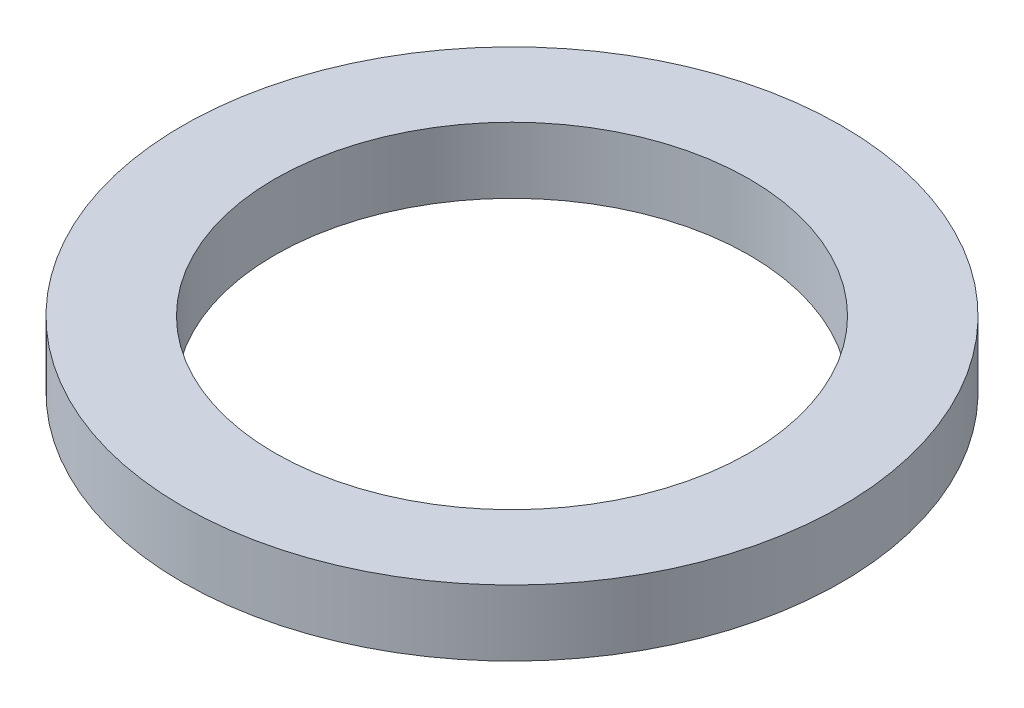
ISO-10303-21;
HEADER;
FILE_DESCRIPTION(('STEP AP214'),'2;1');
FILE_NAME('part.step','',(''),(''),'','','');
FILE_SCHEMA(('AUTOMOTIVE_DESIGN { 1 0 10303 214 1 1 1 1 }'));
ENDSEC;
DATA;
#1=APPLICATION_CONTEXT('core data for automotive mechanical design processes');
#2=APPLICATION_PROTOCOL_DEFINITION('international standard','automotive_design',2000,#1);
#3=PRODUCT_CONTEXT('',#1,'mechanical');
#4=PRODUCT('Part','Part','',(#3));
#5=PRODUCT_RELATED_PRODUCT_CATEGORY('part','',(#4));
#6=PRODUCT_DEFINITION_FORMATION('','',#4);
#7=PRODUCT_DEFINITION_CONTEXT('part definition',#1,'design');
#8=PRODUCT_DEFINITION('design','',#6,#7);
#9=PRODUCT_DEFINITION_SHAPE('','',#8);
#10=(LENGTH_UNIT() NAMED_UNIT(*) SI_UNIT(.MILLI.,.METRE.));
#11=(NAMED_UNIT(*) PLANE_ANGLE_UNIT() SI_UNIT($,.RADIAN.));
#12=(NAMED_UNIT(*) SI_UNIT($,.STERADIAN.) SOLID_ANGLE_UNIT());
#13=UNCERTAINTY_MEASURE_WITH_UNIT(LENGTH_MEASURE(1.E-05),#10,'distance_accuracy_value','');
#14=(GEOMETRIC_REPRESENTATION_CONTEXT(3) GLOBAL_UNCERTAINTY_ASSIGNED_CONTEXT((#13)) GLOBAL_UNIT_ASSIGNED_CONTEXT((#10,
#11,#12)) REPRESENTATION_CONTEXT('',''));
#15=CARTESIAN_POINT('',(0.,0.,0.));
#16=DIRECTION('',(0.,0.,1.));
#17=DIRECTION('',(1.,0.,0.));
#18=AXIS2_PLACEMENT_3D('',#15,#16,#17);
#19=CARTESIAN_POINT('',(0.,10.,0.));
#20=DIRECTION('',(0.,1.,0.));
#21=DIRECTION('',(0.,0.,1.));
#22=AXIS2_PLACEMENT_3D('',#19,#20,#21);
#23=PLANE('',#22);
#24=CARTESIAN_POINT('',(0.,10.,0.));
#25=DIRECTION('',(0.,1.,0.));
#26=DIRECTION('',(0.,0.,1.));
#27=AXIS2_PLACEMENT_3D('',#24,#25,#26);
#28=CIRCLE('',#27,36.);
#29=CARTESIAN_POINT('',(0.,10.,36.));
#30=VERTEX_POINT('',#29);
#31=EDGE_CURVE('E26',#30,#30,#28,.F.);
#32=ORIENTED_EDGE('',*,*,#31,.T.);
#33=EDGE_LOOP('',(#32));
#34=FACE_BOUND('',#33,.T.);
#35=CARTESIAN_POINT('',(0.,10.,0.));
#36=DIRECTION('',(0.,1.,0.));
#37=DIRECTION('',(0.,0.,1.));
#38=AXIS2_PLACEMENT_3D('',#35,#36,#37);
#39=CIRCLE('',#38,50.);
#40=CARTESIAN_POINT('',(0.,10.,50.));
#41=VERTEX_POINT('',#40);
#42=EDGE_CURVE('E17',#41,#41,#39,.F.);
#43=ORIENTED_EDGE('',*,*,#42,.F.);
#44=EDGE_LOOP('',(#43));
#45=FACE_BOUND('',#44,.T.);
#46=ADVANCED_FACE('F14',(#34,#45),#23,.T.);
#47=CARTESIAN_POINT('',(0.,0.,0.));
#48=DIRECTION('',(0.,1.,0.));
#49=DIRECTION('',(0.,0.,1.));
#50=AXIS2_PLACEMENT_3D('',#47,#48,#49);
#51=CYLINDRICAL_SURFACE('',#50,50.);
#52=ORIENTED_EDGE('',*,*,#42,.T.);
#53=EDGE_LOOP('',(#52));
#54=FACE_BOUND('',#53,.T.);
#55=CARTESIAN_POINT('',(0.,0.,0.));
#56=DIRECTION('',(0.,1.,0.));
#57=DIRECTION('',(0.,0.,1.));
#58=AXIS2_PLACEMENT_3D('',#55,#56,#57);
#59=CIRCLE('',#58,50.);
#60=CARTESIAN_POINT('',(0.,0.,50.));
#61=VERTEX_POINT('',#60);
#62=EDGE_CURVE('E21',#61,#61,#59,.T.);
#63=ORIENTED_EDGE('',*,*,#62,.T.);
#64=EDGE_LOOP('',(#63));
#65=FACE_BOUND('',#64,.T.);
#66=ADVANCED_FACE('F34',(#54,#65),#51,.T.);
#67=CARTESIAN_POINT('',(0.,0.,0.));
#68=DIRECTION('',(0.,1.,0.));
#69=DIRECTION('',(0.,0.,1.));
#70=AXIS2_PLACEMENT_3D('',#67,#68,#69);
#71=CYLINDRICAL_SURFACE('',#70,36.);
#72=ORIENTED_EDGE('',*,*,#31,.F.);
#73=EDGE_LOOP('',(#72));
#74=FACE_BOUND('',#73,.T.);
#75=CARTESIAN_POINT('',(0.,0.,0.));
#76=DIRECTION('',(0.,1.,0.));
#77=DIRECTION('',(0.,0.,1.));
#78=AXIS2_PLACEMENT_3D('',#75,#76,#77);
#79=CIRCLE('',#78,36.);
#80=CARTESIAN_POINT('',(0.,0.,36.));
#81=VERTEX_POINT('',#80);
#82=EDGE_CURVE('E10',#81,#81,#79,.F.);
#83=ORIENTED_EDGE('',*,*,#82,.T.);
#84=EDGE_LOOP('',(#83));
#85=FACE_BOUND('',#84,.T.);
#86=ADVANCED_FACE('F42',(#74,#85),#71,.F.);
#87=CARTESIAN_POINT('',(0.,0.,0.));
#88=DIRECTION('',(0.,1.,0.));
#89=DIRECTION('',(0.,0.,1.));
#90=AXIS2_PLACEMENT_3D('',#87,#88,#89);
#91=PLANE('',#90);
#92=ORIENTED_EDGE('',*,*,#82,.F.);
#93=EDGE_LOOP('',(#92));
#94=FACE_BOUND('',#93,.T.);
#95=ORIENTED_EDGE('',*,*,#62,.F.);
#96=EDGE_LOOP('',(#95));
#97=FACE_BOUND('',#96,.T.);
#98=ADVANCED_FACE('F43',(#94,#97),#91,.F.);
#99=CLOSED_SHELL('',(#46,#66,#86,#98));
#100=MANIFOLD_SOLID_BREP('B1',#99);
#101=ADVANCED_BREP_SHAPE_REPRESENTATION('',(#18,#100),#14);
#102=SHAPE_DEFINITION_REPRESENTATION(#9,#101);
ENDSEC;
END-ISO-10303-21;
